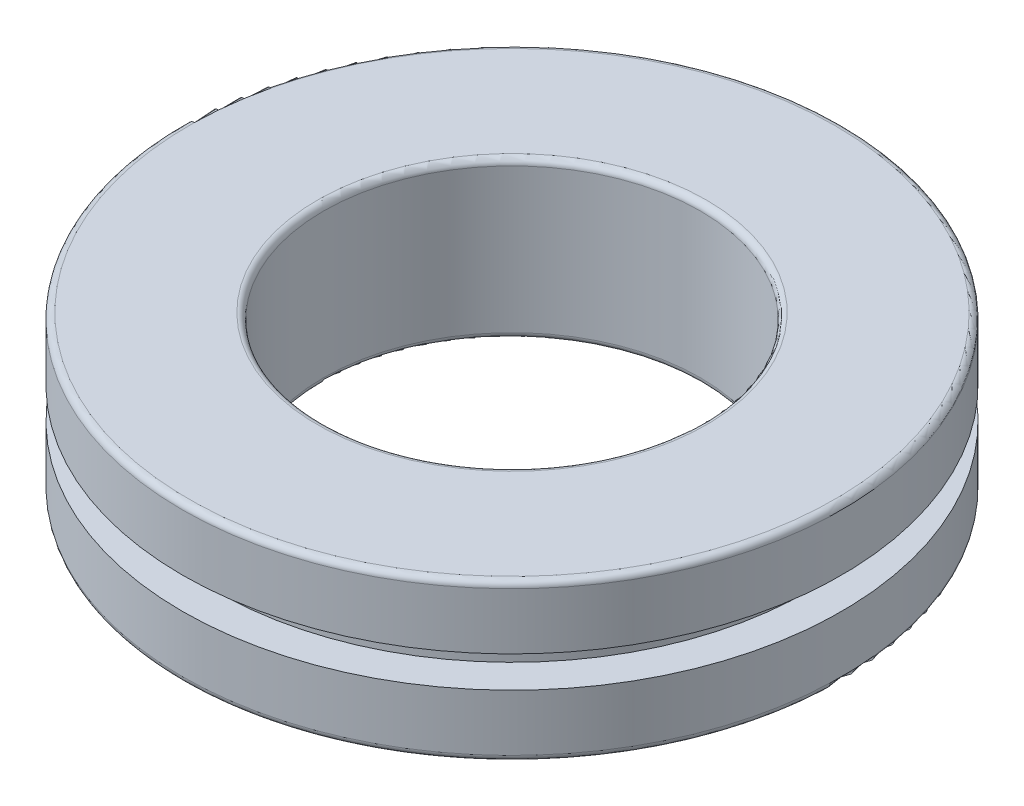
ISO-10303-21;
HEADER;
FILE_DESCRIPTION(('STEP AP214'),'2;1');
FILE_NAME('part.step','',(''),(''),'','','');
FILE_SCHEMA(('AUTOMOTIVE_DESIGN { 1 0 10303 214 1 1 1 1 }'));
ENDSEC;
DATA;
#1=APPLICATION_CONTEXT('core data for automotive mechanical design processes');
#2=APPLICATION_PROTOCOL_DEFINITION('international standard','automotive_design',2000,#1);
#3=PRODUCT_CONTEXT('',#1,'mechanical');
#4=PRODUCT('Part','Part','',(#3));
#5=PRODUCT_RELATED_PRODUCT_CATEGORY('part','',(#4));
#6=PRODUCT_DEFINITION_FORMATION('','',#4);
#7=PRODUCT_DEFINITION_CONTEXT('part definition',#1,'design');
#8=PRODUCT_DEFINITION('design','',#6,#7);
#9=PRODUCT_DEFINITION_SHAPE('','',#8);
#10=(LENGTH_UNIT() NAMED_UNIT(*) SI_UNIT(.MILLI.,.METRE.));
#11=(NAMED_UNIT(*) PLANE_ANGLE_UNIT() SI_UNIT($,.RADIAN.));
#12=(NAMED_UNIT(*) SI_UNIT($,.STERADIAN.) SOLID_ANGLE_UNIT());
#13=UNCERTAINTY_MEASURE_WITH_UNIT(LENGTH_MEASURE(1.E-05),#10,'distance_accuracy_value','');
#14=(GEOMETRIC_REPRESENTATION_CONTEXT(3) GLOBAL_UNCERTAINTY_ASSIGNED_CONTEXT((#13)) GLOBAL_UNIT_ASSIGNED_CONTEXT((#10,
#11,#12)) REPRESENTATION_CONTEXT('',''));
#15=CARTESIAN_POINT('',(0.,0.,0.));
#16=DIRECTION('',(0.,0.,1.));
#17=DIRECTION('',(1.,0.,0.));
#18=AXIS2_PLACEMENT_3D('',#15,#16,#17);
#19=CARTESIAN_POINT('',(10.5,3.,0.));
#20=DIRECTION('',(0.,-1.,0.));
#21=DIRECTION('',(0.,0.,-1.));
#22=AXIS2_PLACEMENT_3D('',#19,#20,#21);
#23=PLANE('',#22);
#24=CARTESIAN_POINT('',(0.,3.,0.));
#25=DIRECTION('',(0.,-1.,0.));
#26=DIRECTION('',(0.,0.,-1.));
#27=AXIS2_PLACEMENT_3D('',#24,#25,#26);
#28=CIRCLE('',#27,10.5);
#29=CARTESIAN_POINT('',(0.,3.,-10.5));
#30=VERTEX_POINT('',#29);
#31=EDGE_CURVE('E90',#30,#30,#28,.T.);
#32=ORIENTED_EDGE('',*,*,#31,.T.);
#33=EDGE_LOOP('',(#32));
#34=FACE_BOUND('',#33,.T.);
#35=CARTESIAN_POINT('',(0.,3.,0.));
#36=DIRECTION('',(0.,-1.,0.));
#37=DIRECTION('',(0.,0.,-1.));
#38=AXIS2_PLACEMENT_3D('',#35,#36,#37);
#39=CIRCLE('',#38,9.41191557588329);
#40=CARTESIAN_POINT('',(0.,3.,-9.41191557588329));
#41=VERTEX_POINT('',#40);
#42=EDGE_CURVE('E10',#41,#41,#39,.T.);
#43=ORIENTED_EDGE('',*,*,#42,.F.);
#44=EDGE_LOOP('',(#43));
#45=FACE_BOUND('',#44,.T.);
#46=ADVANCED_FACE('F39',(#34,#45),#23,.T.);
#47=CARTESIAN_POINT('',(0.,0.,0.));
#48=DIRECTION('',(0.,-1.,0.));
#49=DIRECTION('',(0.,0.,-1.));
#50=AXIS2_PLACEMENT_3D('',#47,#48,#49);
#51=CYLINDRICAL_SURFACE('',#50,9.41191557588329);
#52=ORIENTED_EDGE('',*,*,#42,.T.);
#53=EDGE_LOOP('',(#52));
#54=FACE_BOUND('',#53,.T.);
#55=CARTESIAN_POINT('',(0.,2.,0.));
#56=DIRECTION('',(0.,-1.,0.));
#57=DIRECTION('',(0.,0.,-1.));
#58=AXIS2_PLACEMENT_3D('',#55,#56,#57);
#59=CIRCLE('',#58,9.41191557588329);
#60=CARTESIAN_POINT('',(0.,2.,-9.41191557588329));
#61=VERTEX_POINT('',#60);
#62=EDGE_CURVE('E46',#61,#61,#59,.T.);
#63=ORIENTED_EDGE('',*,*,#62,.F.);
#64=EDGE_LOOP('',(#63));
#65=FACE_BOUND('',#64,.T.);
#66=ADVANCED_FACE('F109',(#54,#65),#51,.T.);
#67=CARTESIAN_POINT('',(9.41191557588329,2.,0.));
#68=DIRECTION('',(0.,1.,0.));
#69=DIRECTION('',(0.,0.,1.));
#70=AXIS2_PLACEMENT_3D('',#67,#68,#69);
#71=PLANE('',#70);
#72=ORIENTED_EDGE('',*,*,#62,.T.);
#73=EDGE_LOOP('',(#72));
#74=FACE_BOUND('',#73,.T.);
#75=CARTESIAN_POINT('',(0.,2.,0.));
#76=DIRECTION('',(0.,-1.,0.));
#77=DIRECTION('',(0.,0.,-1.));
#78=AXIS2_PLACEMENT_3D('',#75,#76,#77);
#79=CIRCLE('',#78,10.5);
#80=CARTESIAN_POINT('',(0.,2.,-10.5));
#81=VERTEX_POINT('',#80);
#82=EDGE_CURVE('E51',#81,#81,#79,.T.);
#83=ORIENTED_EDGE('',*,*,#82,.F.);
#84=EDGE_LOOP('',(#83));
#85=FACE_BOUND('',#84,.T.);
#86=ADVANCED_FACE('F113',(#74,#85),#71,.T.);
#87=CARTESIAN_POINT('',(0.,0.,0.));
#88=DIRECTION('',(0.,-1.,0.));
#89=DIRECTION('',(0.,0.,-1.));
#90=AXIS2_PLACEMENT_3D('',#87,#88,#89);
#91=CYLINDRICAL_SURFACE('',#90,10.5);
#92=ORIENTED_EDGE('',*,*,#82,.T.);
#93=EDGE_LOOP('',(#92));
#94=FACE_BOUND('',#93,.T.);
#95=CARTESIAN_POINT('',(0.,0.200000000000002,0.));
#96=DIRECTION('',(0.,-1.,0.));
#97=DIRECTION('',(0.,0.,-1.));
#98=AXIS2_PLACEMENT_3D('',#95,#96,#97);
#99=CIRCLE('',#98,10.5);
#100=CARTESIAN_POINT('',(0.,0.200000000000002,-10.5));
#101=VERTEX_POINT('',#100);
#102=EDGE_CURVE('E56',#101,#101,#99,.T.);
#103=ORIENTED_EDGE('',*,*,#102,.F.);
#104=EDGE_LOOP('',(#103));
#105=FACE_BOUND('',#104,.T.);
#106=ADVANCED_FACE('F117',(#94,#105),#91,.T.);
#107=CARTESIAN_POINT('',(0.,0.200000000000001,0.));
#108=DIRECTION('',(0.,-1.,0.));
#109=DIRECTION('',(0.,0.,-1.));
#110=AXIS2_PLACEMENT_3D('',#107,#108,#109);
#111=TOROIDAL_SURFACE('',#110,10.3,0.2);
#112=ORIENTED_EDGE('',*,*,#102,.T.);
#113=EDGE_LOOP('',(#112));
#114=FACE_BOUND('',#113,.T.);
#115=CARTESIAN_POINT('',(0.,0.,0.));
#116=DIRECTION('',(0.,-1.,0.));
#117=DIRECTION('',(0.,0.,-1.));
#118=AXIS2_PLACEMENT_3D('',#115,#116,#117);
#119=CIRCLE('',#118,10.3);
#120=CARTESIAN_POINT('',(0.,0.,-10.3));
#121=VERTEX_POINT('',#120);
#122=EDGE_CURVE('E62',#121,#121,#119,.T.);
#123=ORIENTED_EDGE('',*,*,#122,.F.);
#124=EDGE_LOOP('',(#123));
#125=FACE_BOUND('',#124,.T.);
#126=ADVANCED_FACE('F123',(#114,#125),#111,.T.);
#127=CARTESIAN_POINT('',(10.3,0.,0.));
#128=DIRECTION('',(0.,-1.,0.));
#129=DIRECTION('',(0.,0.,-1.));
#130=AXIS2_PLACEMENT_3D('',#127,#128,#129);
#131=PLANE('',#130);
#132=ORIENTED_EDGE('',*,*,#122,.T.);
#133=EDGE_LOOP('',(#132));
#134=FACE_BOUND('',#133,.T.);
#135=CARTESIAN_POINT('',(0.,0.,0.));
#136=DIRECTION('',(0.,-1.,0.));
#137=DIRECTION('',(0.,0.,-1.));
#138=AXIS2_PLACEMENT_3D('',#135,#136,#137);
#139=CIRCLE('',#138,6.2);
#140=CARTESIAN_POINT('',(0.,0.,-6.2));
#141=VERTEX_POINT('',#140);
#142=EDGE_CURVE('E66',#141,#141,#139,.T.);
#143=ORIENTED_EDGE('',*,*,#142,.F.);
#144=EDGE_LOOP('',(#143));
#145=FACE_BOUND('',#144,.T.);
#146=ADVANCED_FACE('F127',(#134,#145),#131,.T.);
#147=CARTESIAN_POINT('',(0.,0.2,0.));
#148=DIRECTION('',(0.,-1.,0.));
#149=DIRECTION('',(0.,0.,-1.));
#150=AXIS2_PLACEMENT_3D('',#147,#148,#149);
#151=TOROIDAL_SURFACE('',#150,6.2,0.2);
#152=ORIENTED_EDGE('',*,*,#142,.T.);
#153=EDGE_LOOP('',(#152));
#154=FACE_BOUND('',#153,.T.);
#155=CARTESIAN_POINT('',(0.,0.200000000000001,0.));
#156=DIRECTION('',(0.,-1.,0.));
#157=DIRECTION('',(0.,0.,-1.));
#158=AXIS2_PLACEMENT_3D('',#155,#156,#157);
#159=CIRCLE('',#158,6.);
#160=CARTESIAN_POINT('',(0.,0.200000000000001,-6.));
#161=VERTEX_POINT('',#160);
#162=EDGE_CURVE('E70',#161,#161,#159,.T.);
#163=ORIENTED_EDGE('',*,*,#162,.F.);
#164=EDGE_LOOP('',(#163));
#165=FACE_BOUND('',#164,.T.);
#166=ADVANCED_FACE('F131',(#154,#165),#151,.T.);
#167=CARTESIAN_POINT('',(0.,0.,0.));
#168=DIRECTION('',(0.,-1.,0.));
#169=DIRECTION('',(0.,0.,-1.));
#170=AXIS2_PLACEMENT_3D('',#167,#168,#169);
#171=CYLINDRICAL_SURFACE('',#170,6.);
#172=ORIENTED_EDGE('',*,*,#162,.T.);
#173=EDGE_LOOP('',(#172));
#174=FACE_BOUND('',#173,.T.);
#175=CARTESIAN_POINT('',(0.,4.8,0.));
#176=DIRECTION('',(0.,-1.,0.));
#177=DIRECTION('',(0.,0.,-1.));
#178=AXIS2_PLACEMENT_3D('',#175,#176,#177);
#179=CIRCLE('',#178,6.);
#180=CARTESIAN_POINT('',(0.,4.8,-6.));
#181=VERTEX_POINT('',#180);
#182=EDGE_CURVE('E74',#181,#181,#179,.T.);
#183=ORIENTED_EDGE('',*,*,#182,.F.);
#184=EDGE_LOOP('',(#183));
#185=FACE_BOUND('',#184,.T.);
#186=ADVANCED_FACE('F135',(#174,#185),#171,.F.);
#187=CARTESIAN_POINT('',(0.,4.8,0.));
#188=DIRECTION('',(0.,-1.,0.));
#189=DIRECTION('',(0.,0.,-1.));
#190=AXIS2_PLACEMENT_3D('',#187,#188,#189);
#191=TOROIDAL_SURFACE('',#190,6.2,0.2);
#192=ORIENTED_EDGE('',*,*,#182,.T.);
#193=EDGE_LOOP('',(#192));
#194=FACE_BOUND('',#193,.T.);
#195=CARTESIAN_POINT('',(0.,5.,0.));
#196=DIRECTION('',(0.,-1.,0.));
#197=DIRECTION('',(0.,0.,-1.));
#198=AXIS2_PLACEMENT_3D('',#195,#196,#197);
#199=CIRCLE('',#198,6.2);
#200=CARTESIAN_POINT('',(0.,5.,-6.2));
#201=VERTEX_POINT('',#200);
#202=EDGE_CURVE('E78',#201,#201,#199,.T.);
#203=ORIENTED_EDGE('',*,*,#202,.F.);
#204=EDGE_LOOP('',(#203));
#205=FACE_BOUND('',#204,.T.);
#206=ADVANCED_FACE('F139',(#194,#205),#191,.T.);
#207=CARTESIAN_POINT('',(6.2,5.,0.));
#208=DIRECTION('',(0.,1.,0.));
#209=DIRECTION('',(0.,0.,1.));
#210=AXIS2_PLACEMENT_3D('',#207,#208,#209);
#211=PLANE('',#210);
#212=ORIENTED_EDGE('',*,*,#202,.T.);
#213=EDGE_LOOP('',(#212));
#214=FACE_BOUND('',#213,.T.);
#215=CARTESIAN_POINT('',(0.,5.,0.));
#216=DIRECTION('',(0.,-1.,0.));
#217=DIRECTION('',(0.,0.,-1.));
#218=AXIS2_PLACEMENT_3D('',#215,#216,#217);
#219=CIRCLE('',#218,10.3);
#220=CARTESIAN_POINT('',(0.,5.,-10.3));
#221=VERTEX_POINT('',#220);
#222=EDGE_CURVE('E82',#221,#221,#219,.T.);
#223=ORIENTED_EDGE('',*,*,#222,.F.);
#224=EDGE_LOOP('',(#223));
#225=FACE_BOUND('',#224,.T.);
#226=ADVANCED_FACE('F105',(#214,#225),#211,.T.);
#227=CARTESIAN_POINT('',(0.,4.8,0.));
#228=DIRECTION('',(0.,-1.,0.));
#229=DIRECTION('',(0.,0.,-1.));
#230=AXIS2_PLACEMENT_3D('',#227,#228,#229);
#231=TOROIDAL_SURFACE('',#230,10.3,0.2);
#232=ORIENTED_EDGE('',*,*,#222,.T.);
#233=EDGE_LOOP('',(#232));
#234=FACE_BOUND('',#233,.T.);
#235=CARTESIAN_POINT('',(0.,4.8,0.));
#236=DIRECTION('',(0.,-1.,0.));
#237=DIRECTION('',(0.,0.,-1.));
#238=AXIS2_PLACEMENT_3D('',#235,#236,#237);
#239=CIRCLE('',#238,10.5);
#240=CARTESIAN_POINT('',(0.,4.8,-10.5));
#241=VERTEX_POINT('',#240);
#242=EDGE_CURVE('E86',#241,#241,#239,.T.);
#243=ORIENTED_EDGE('',*,*,#242,.F.);
#244=EDGE_LOOP('',(#243));
#245=FACE_BOUND('',#244,.T.);
#246=ADVANCED_FACE('F99',(#234,#245),#231,.T.);
#247=CARTESIAN_POINT('',(0.,0.,0.));
#248=DIRECTION('',(0.,-1.,0.));
#249=DIRECTION('',(0.,0.,-1.));
#250=AXIS2_PLACEMENT_3D('',#247,#248,#249);
#251=CYLINDRICAL_SURFACE('',#250,10.5);
#252=ORIENTED_EDGE('',*,*,#242,.T.);
#253=EDGE_LOOP('',(#252));
#254=FACE_BOUND('',#253,.T.);
#255=ORIENTED_EDGE('',*,*,#31,.F.);
#256=EDGE_LOOP('',(#255));
#257=FACE_BOUND('',#256,.T.);
#258=ADVANCED_FACE('F97',(#254,#257),#251,.T.);
#259=CLOSED_SHELL('',(#46,#66,#86,#106,#126,#146,#166,#186,#206,#226,#246,#258));
#260=MANIFOLD_SOLID_BREP('B2',#259);
#261=ADVANCED_BREP_SHAPE_REPRESENTATION('',(#18,#260),#14);
#262=SHAPE_DEFINITION_REPRESENTATION(#9,#261);
ENDSEC;
END-ISO-10303-21;
